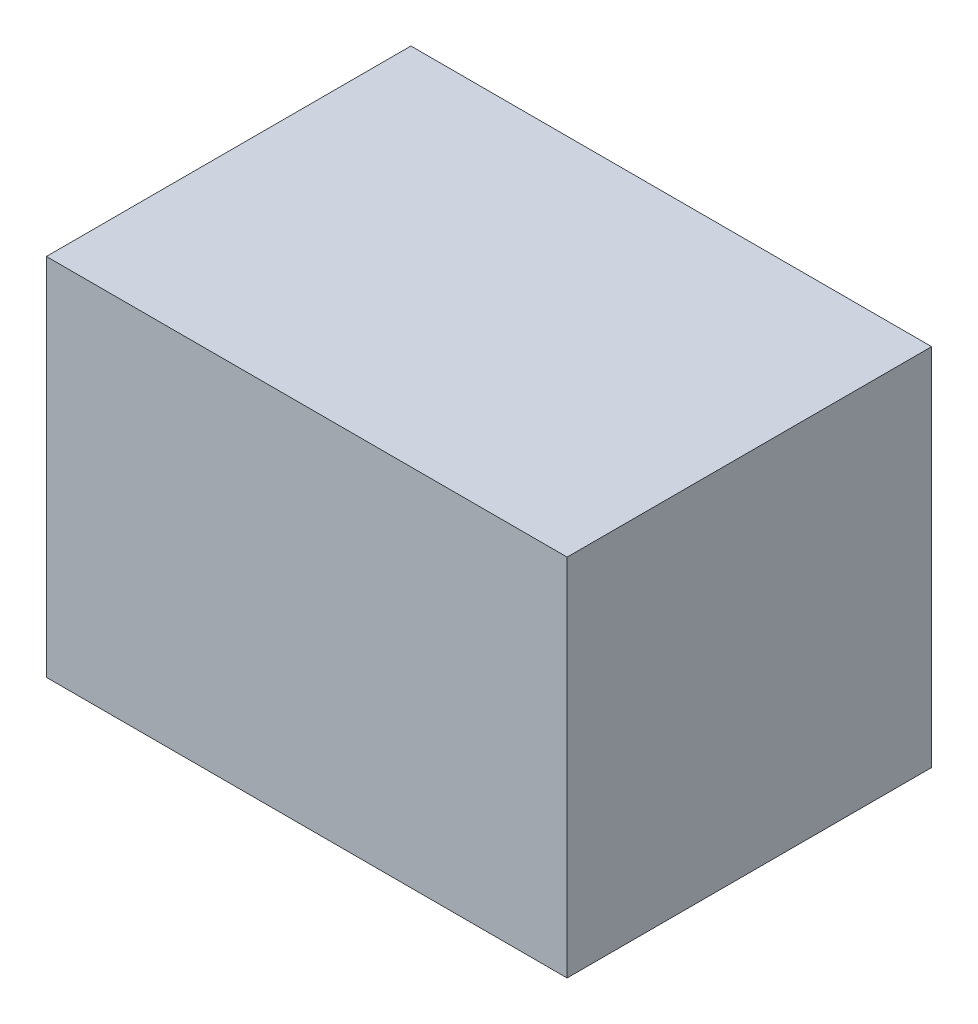
ISO-10303-21;
HEADER;
FILE_DESCRIPTION(('STEP AP214'),'2;1');
FILE_NAME('part.step','',(''),(''),'','','');
FILE_SCHEMA(('AUTOMOTIVE_DESIGN { 1 0 10303 214 1 1 1 1 }'));
ENDSEC;
DATA;
#1=APPLICATION_CONTEXT('core data for automotive mechanical design processes');
#2=APPLICATION_PROTOCOL_DEFINITION('international standard','automotive_design',2000,#1);
#3=PRODUCT_CONTEXT('',#1,'mechanical');
#4=PRODUCT('Part','Part','',(#3));
#5=PRODUCT_RELATED_PRODUCT_CATEGORY('part','',(#4));
#6=PRODUCT_DEFINITION_FORMATION('','',#4);
#7=PRODUCT_DEFINITION_CONTEXT('part definition',#1,'design');
#8=PRODUCT_DEFINITION('design','',#6,#7);
#9=PRODUCT_DEFINITION_SHAPE('','',#8);
#10=(LENGTH_UNIT() NAMED_UNIT(*) SI_UNIT(.MILLI.,.METRE.));
#11=(NAMED_UNIT(*) PLANE_ANGLE_UNIT() SI_UNIT($,.RADIAN.));
#12=(NAMED_UNIT(*) SI_UNIT($,.STERADIAN.) SOLID_ANGLE_UNIT());
#13=UNCERTAINTY_MEASURE_WITH_UNIT(LENGTH_MEASURE(1.E-05),#10,'distance_accuracy_value','');
#14=(GEOMETRIC_REPRESENTATION_CONTEXT(3) GLOBAL_UNCERTAINTY_ASSIGNED_CONTEXT((#13)) GLOBAL_UNIT_ASSIGNED_CONTEXT((#10,
#11,#12)) REPRESENTATION_CONTEXT('',''));
#15=CARTESIAN_POINT('',(0.,0.,0.));
#16=DIRECTION('',(0.,0.,1.));
#17=DIRECTION('',(1.,0.,0.));
#18=AXIS2_PLACEMENT_3D('',#15,#16,#17);
#19=CARTESIAN_POINT('',(-2.54,0.,0.));
#20=DIRECTION('',(0.,1.,0.));
#21=DIRECTION('',(1.,0.,0.));
#22=AXIS2_PLACEMENT_3D('',#19,#20,#21);
#23=PLANE('',#22);
#24=DIRECTION('',(0.,0.,1.));
#25=VECTOR('',#24,1.);
#26=CARTESIAN_POINT('',(12.45,0.,0.749999999999982));
#27=LINE('',#26,#25);
#28=CARTESIAN_POINT('',(12.45,0.,0.749999999999982));
#29=VERTEX_POINT('',#28);
#30=CARTESIAN_POINT('',(12.45,0.,1.1));
#31=VERTEX_POINT('',#30);
#32=EDGE_CURVE('E110',#29,#31,#27,.T.);
#33=ORIENTED_EDGE('',*,*,#32,.T.);
#34=DIRECTION('',(1.,0.,0.));
#35=VECTOR('',#34,1.);
#36=CARTESIAN_POINT('',(12.45,0.,1.1));
#37=LINE('',#36,#35);
#38=CARTESIAN_POINT('',(12.95,0.,1.1));
#39=VERTEX_POINT('',#38);
#40=EDGE_CURVE('E27',#31,#39,#37,.T.);
#41=ORIENTED_EDGE('',*,*,#40,.T.);
#42=DIRECTION('',(0.,0.,1.));
#43=VECTOR('',#42,1.);
#44=CARTESIAN_POINT('',(12.95,0.,0.749999999999982));
#45=LINE('',#44,#43);
#46=CARTESIAN_POINT('',(12.95,0.,0.749999999999982));
#47=VERTEX_POINT('',#46);
#48=EDGE_CURVE('E75',#47,#39,#45,.T.);
#49=ORIENTED_EDGE('',*,*,#48,.F.);
#50=DIRECTION('',(1.,0.,0.));
#51=VECTOR('',#50,1.);
#52=CARTESIAN_POINT('',(12.45,0.,0.749999999999982));
#53=LINE('',#52,#51);
#54=EDGE_CURVE('E20',#29,#47,#53,.T.);
#55=ORIENTED_EDGE('',*,*,#54,.F.);
#56=EDGE_LOOP('',(#33,#41,#49,#55));
#57=FACE_BOUND('',#56,.T.);
#58=ADVANCED_FACE('F16',(#57),#23,.T.);
#59=CARTESIAN_POINT('',(-2.54,-0.35,0.));
#60=DIRECTION('',(0.,1.,0.));
#61=DIRECTION('',(1.,0.,0.));
#62=AXIS2_PLACEMENT_3D('',#59,#60,#61);
#63=PLANE('',#62);
#64=DIRECTION('',(0.,0.,1.));
#65=VECTOR('',#64,1.);
#66=CARTESIAN_POINT('',(12.45,-0.35,0.749999999999982));
#67=LINE('',#66,#65);
#68=CARTESIAN_POINT('',(12.45,-0.35,0.749999999999982));
#69=VERTEX_POINT('',#68);
#70=CARTESIAN_POINT('',(12.45,-0.35,1.1));
#71=VERTEX_POINT('',#70);
#72=EDGE_CURVE('E101',#69,#71,#67,.T.);
#73=ORIENTED_EDGE('',*,*,#72,.F.);
#74=DIRECTION('',(1.,0.,0.));
#75=VECTOR('',#74,1.);
#76=CARTESIAN_POINT('',(12.45,-0.35,0.749999999999982));
#77=LINE('',#76,#75);
#78=CARTESIAN_POINT('',(12.95,-0.35,0.749999999999982));
#79=VERTEX_POINT('',#78);
#80=EDGE_CURVE('E81',#69,#79,#77,.T.);
#81=ORIENTED_EDGE('',*,*,#80,.T.);
#82=DIRECTION('',(0.,0.,1.));
#83=VECTOR('',#82,1.);
#84=CARTESIAN_POINT('',(12.95,-0.35,0.749999999999982));
#85=LINE('',#84,#83);
#86=CARTESIAN_POINT('',(12.95,-0.35,1.1));
#87=VERTEX_POINT('',#86);
#88=EDGE_CURVE('E65',#79,#87,#85,.T.);
#89=ORIENTED_EDGE('',*,*,#88,.T.);
#90=DIRECTION('',(1.,0.,0.));
#91=VECTOR('',#90,1.);
#92=CARTESIAN_POINT('',(12.45,-0.35,1.1));
#93=LINE('',#92,#91);
#94=EDGE_CURVE('E11',#71,#87,#93,.T.);
#95=ORIENTED_EDGE('',*,*,#94,.F.);
#96=EDGE_LOOP('',(#73,#81,#89,#95));
#97=FACE_BOUND('',#96,.T.);
#98=ADVANCED_FACE('F124',(#97),#63,.F.);
#99=CARTESIAN_POINT('',(12.45,-0.35,1.1));
#100=DIRECTION('',(0.,0.,1.));
#101=DIRECTION('',(1.,0.,0.));
#102=AXIS2_PLACEMENT_3D('',#99,#100,#101);
#103=PLANE('',#102);
#104=ORIENTED_EDGE('',*,*,#40,.F.);
#105=DIRECTION('',(0.,1.,0.));
#106=VECTOR('',#105,1.);
#107=CARTESIAN_POINT('',(12.45,-0.35,1.1));
#108=LINE('',#107,#106);
#109=EDGE_CURVE('E94',#71,#31,#108,.T.);
#110=ORIENTED_EDGE('',*,*,#109,.F.);
#111=ORIENTED_EDGE('',*,*,#94,.T.);
#112=DIRECTION('',(0.,1.,0.));
#113=VECTOR('',#112,1.);
#114=CARTESIAN_POINT('',(12.95,-0.35,1.1));
#115=LINE('',#114,#113);
#116=EDGE_CURVE('E80',#87,#39,#115,.T.);
#117=ORIENTED_EDGE('',*,*,#116,.T.);
#118=EDGE_LOOP('',(#104,#110,#111,#117));
#119=FACE_BOUND('',#118,.T.);
#120=ADVANCED_FACE('F18',(#119),#103,.T.);
#121=CARTESIAN_POINT('',(12.95,-0.35,0.749999999999982));
#122=DIRECTION('',(-1.,0.,0.));
#123=DIRECTION('',(0.,0.,1.));
#124=AXIS2_PLACEMENT_3D('',#121,#122,#123);
#125=PLANE('',#124);
#126=ORIENTED_EDGE('',*,*,#48,.T.);
#127=ORIENTED_EDGE('',*,*,#116,.F.);
#128=ORIENTED_EDGE('',*,*,#88,.F.);
#129=DIRECTION('',(0.,1.,0.));
#130=VECTOR('',#129,1.);
#131=CARTESIAN_POINT('',(12.95,-0.35,0.749999999999982));
#132=LINE('',#131,#130);
#133=EDGE_CURVE('E84',#79,#47,#132,.T.);
#134=ORIENTED_EDGE('',*,*,#133,.T.);
#135=EDGE_LOOP('',(#126,#127,#128,#134));
#136=FACE_BOUND('',#135,.T.);
#137=ADVANCED_FACE('F85',(#136),#125,.F.);
#138=CARTESIAN_POINT('',(12.45,-0.35,0.749999999999982));
#139=DIRECTION('',(0.,0.,1.));
#140=DIRECTION('',(1.,0.,0.));
#141=AXIS2_PLACEMENT_3D('',#138,#139,#140);
#142=PLANE('',#141);
#143=ORIENTED_EDGE('',*,*,#54,.T.);
#144=ORIENTED_EDGE('',*,*,#133,.F.);
#145=ORIENTED_EDGE('',*,*,#80,.F.);
#146=DIRECTION('',(0.,1.,0.));
#147=VECTOR('',#146,1.);
#148=CARTESIAN_POINT('',(12.45,-0.35,0.749999999999982));
#149=LINE('',#148,#147);
#150=EDGE_CURVE('E91',#69,#29,#149,.T.);
#151=ORIENTED_EDGE('',*,*,#150,.T.);
#152=EDGE_LOOP('',(#143,#144,#145,#151));
#153=FACE_BOUND('',#152,.T.);
#154=ADVANCED_FACE('F89',(#153),#142,.F.);
#155=CARTESIAN_POINT('',(12.45,-0.35,0.749999999999982));
#156=DIRECTION('',(-1.,0.,0.));
#157=DIRECTION('',(0.,0.,1.));
#158=AXIS2_PLACEMENT_3D('',#155,#156,#157);
#159=PLANE('',#158);
#160=ORIENTED_EDGE('',*,*,#32,.F.);
#161=ORIENTED_EDGE('',*,*,#150,.F.);
#162=ORIENTED_EDGE('',*,*,#72,.T.);
#163=ORIENTED_EDGE('',*,*,#109,.T.);
#164=EDGE_LOOP('',(#160,#161,#162,#163));
#165=FACE_BOUND('',#164,.T.);
#166=ADVANCED_FACE('F125',(#165),#159,.T.);
#167=CLOSED_SHELL('',(#58,#98,#120,#137,#154,#166));
#168=MANIFOLD_SOLID_BREP('B1',#167);
#169=ADVANCED_BREP_SHAPE_REPRESENTATION('',(#18,#168),#14);
#170=SHAPE_DEFINITION_REPRESENTATION(#9,#169);
ENDSEC;
END-ISO-10303-21;
